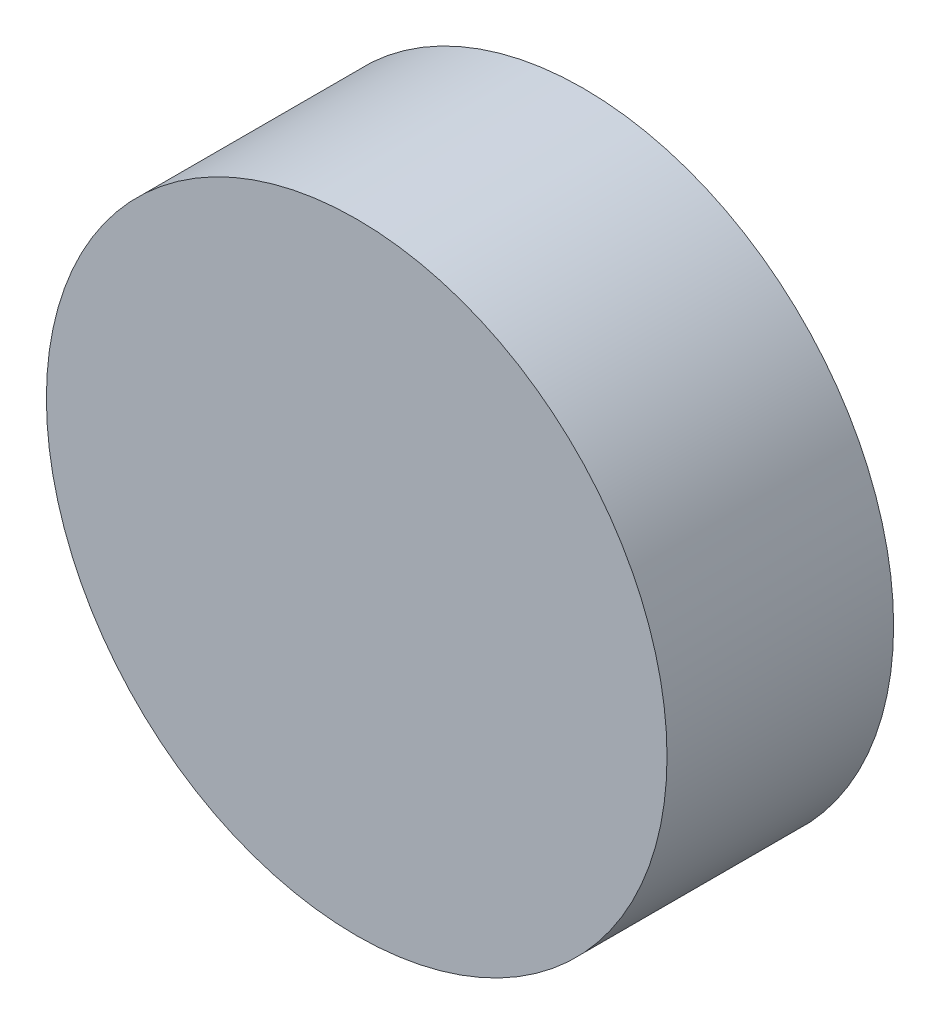
ISO-10303-21;
HEADER;
FILE_DESCRIPTION(('STEP AP214'),'2;1');
FILE_NAME('part.step','',(''),(''),'','','');
FILE_SCHEMA(('AUTOMOTIVE_DESIGN { 1 0 10303 214 1 1 1 1 }'));
ENDSEC;
DATA;
#1=APPLICATION_CONTEXT('core data for automotive mechanical design processes');
#2=APPLICATION_PROTOCOL_DEFINITION('international standard','automotive_design',2000,#1);
#3=PRODUCT_CONTEXT('',#1,'mechanical');
#4=PRODUCT('Part','Part','',(#3));
#5=PRODUCT_RELATED_PRODUCT_CATEGORY('part','',(#4));
#6=PRODUCT_DEFINITION_FORMATION('','',#4);
#7=PRODUCT_DEFINITION_CONTEXT('part definition',#1,'design');
#8=PRODUCT_DEFINITION('design','',#6,#7);
#9=PRODUCT_DEFINITION_SHAPE('','',#8);
#10=(LENGTH_UNIT() NAMED_UNIT(*) SI_UNIT(.MILLI.,.METRE.));
#11=(NAMED_UNIT(*) PLANE_ANGLE_UNIT() SI_UNIT($,.RADIAN.));
#12=(NAMED_UNIT(*) SI_UNIT($,.STERADIAN.) SOLID_ANGLE_UNIT());
#13=UNCERTAINTY_MEASURE_WITH_UNIT(LENGTH_MEASURE(1.E-05),#10,'distance_accuracy_value','');
#14=(GEOMETRIC_REPRESENTATION_CONTEXT(3) GLOBAL_UNCERTAINTY_ASSIGNED_CONTEXT((#13)) GLOBAL_UNIT_ASSIGNED_CONTEXT((#10,
#11,#12)) REPRESENTATION_CONTEXT('',''));
#15=CARTESIAN_POINT('',(0.,0.,0.));
#16=DIRECTION('',(0.,0.,1.));
#17=DIRECTION('',(1.,0.,0.));
#18=AXIS2_PLACEMENT_3D('',#15,#16,#17);
#19=CARTESIAN_POINT('',(20.249587155177,12.3126483669053,2.3));
#20=DIRECTION('',(0.,0.,-1.));
#21=DIRECTION('',(-1.,0.,0.));
#22=AXIS2_PLACEMENT_3D('',#19,#20,#21);
#23=CYLINDRICAL_SURFACE('',#22,3.15);
#24=CARTESIAN_POINT('',(20.249587155177,12.3126483669053,2.3));
#25=DIRECTION('',(0.,0.,1.));
#26=DIRECTION('',(1.,0.,0.));
#27=AXIS2_PLACEMENT_3D('',#24,#25,#26);
#28=CIRCLE('',#27,3.15);
#29=CARTESIAN_POINT('',(23.399587155177,12.3126483669053,2.3));
#30=VERTEX_POINT('',#29);
#31=EDGE_CURVE('E10',#30,#30,#28,.T.);
#32=ORIENTED_EDGE('',*,*,#31,.F.);
#33=EDGE_LOOP('',(#32));
#34=FACE_BOUND('',#33,.T.);
#35=CARTESIAN_POINT('',(20.249587155177,12.3126483669053,0.));
#36=DIRECTION('',(0.,0.,1.));
#37=DIRECTION('',(1.,0.,0.));
#38=AXIS2_PLACEMENT_3D('',#35,#36,#37);
#39=CIRCLE('',#38,3.15);
#40=CARTESIAN_POINT('',(23.399587155177,12.3126483669053,0.));
#41=VERTEX_POINT('',#40);
#42=EDGE_CURVE('E38',#41,#41,#39,.T.);
#43=ORIENTED_EDGE('',*,*,#42,.T.);
#44=EDGE_LOOP('',(#43));
#45=FACE_BOUND('',#44,.T.);
#46=ADVANCED_FACE('F35',(#34,#45),#23,.T.);
#47=CARTESIAN_POINT('',(20.249587155177,12.3126483669053,2.3));
#48=DIRECTION('',(0.,0.,1.));
#49=DIRECTION('',(1.,0.,0.));
#50=AXIS2_PLACEMENT_3D('',#47,#48,#49);
#51=PLANE('',#50);
#52=ORIENTED_EDGE('',*,*,#31,.T.);
#53=EDGE_LOOP('',(#52));
#54=FACE_BOUND('',#53,.T.);
#55=ADVANCED_FACE('F50',(#54),#51,.T.);
#56=CARTESIAN_POINT('',(20.249587155177,12.3126483669053,0.));
#57=DIRECTION('',(0.,0.,1.));
#58=DIRECTION('',(1.,0.,0.));
#59=AXIS2_PLACEMENT_3D('',#56,#57,#58);
#60=PLANE('',#59);
#61=ORIENTED_EDGE('',*,*,#42,.F.);
#62=EDGE_LOOP('',(#61));
#63=FACE_BOUND('',#62,.T.);
#64=ADVANCED_FACE('F48',(#63),#60,.F.);
#65=CLOSED_SHELL('',(#46,#55,#64));
#66=MANIFOLD_SOLID_BREP('B2',#65);
#67=ADVANCED_BREP_SHAPE_REPRESENTATION('',(#18,#66),#14);
#68=SHAPE_DEFINITION_REPRESENTATION(#9,#67);
ENDSEC;
END-ISO-10303-21;
